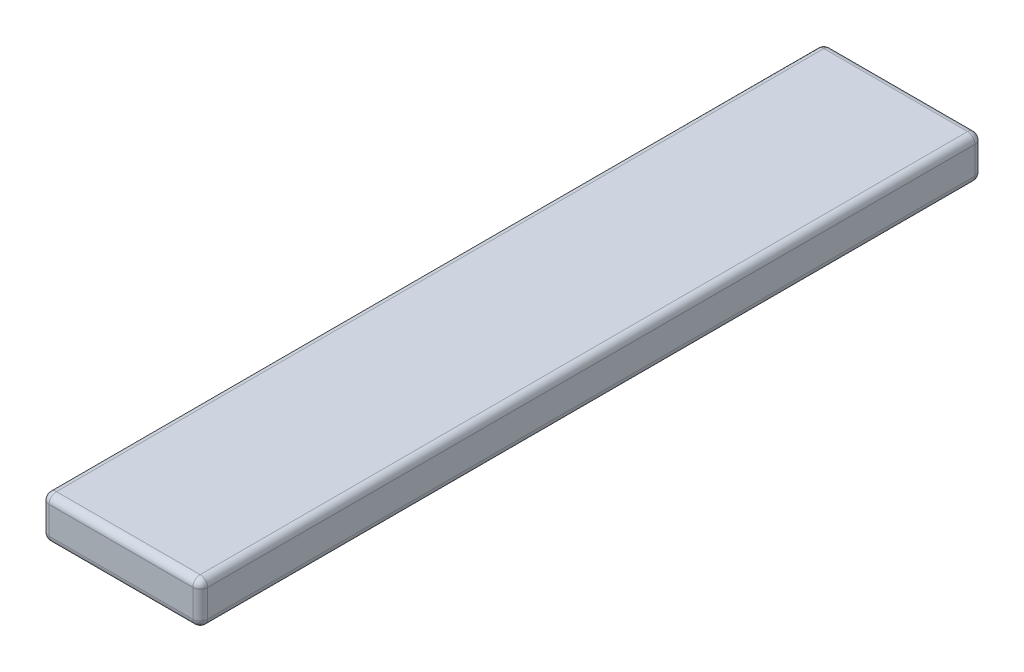
ISO-10303-21;
HEADER;
FILE_DESCRIPTION(('STEP AP214'),'2;1');
FILE_NAME('part.step','',(''),(''),'','','');
FILE_SCHEMA(('AUTOMOTIVE_DESIGN { 1 0 10303 214 1 1 1 1 }'));
ENDSEC;
DATA;
#1=APPLICATION_CONTEXT('core data for automotive mechanical design processes');
#2=APPLICATION_PROTOCOL_DEFINITION('international standard','automotive_design',2000,#1);
#3=PRODUCT_CONTEXT('',#1,'mechanical');
#4=PRODUCT('Part','Part','',(#3));
#5=PRODUCT_RELATED_PRODUCT_CATEGORY('part','',(#4));
#6=PRODUCT_DEFINITION_FORMATION('','',#4);
#7=PRODUCT_DEFINITION_CONTEXT('part definition',#1,'design');
#8=PRODUCT_DEFINITION('design','',#6,#7);
#9=PRODUCT_DEFINITION_SHAPE('','',#8);
#10=(LENGTH_UNIT() NAMED_UNIT(*) SI_UNIT(.MILLI.,.METRE.));
#11=(NAMED_UNIT(*) PLANE_ANGLE_UNIT() SI_UNIT($,.RADIAN.));
#12=(NAMED_UNIT(*) SI_UNIT($,.STERADIAN.) SOLID_ANGLE_UNIT());
#13=UNCERTAINTY_MEASURE_WITH_UNIT(LENGTH_MEASURE(1.E-05),#10,'distance_accuracy_value','');
#14=(GEOMETRIC_REPRESENTATION_CONTEXT(3) GLOBAL_UNCERTAINTY_ASSIGNED_CONTEXT((#13)) GLOBAL_UNIT_ASSIGNED_CONTEXT((#10,
#11,#12)) REPRESENTATION_CONTEXT('',''));
#15=CARTESIAN_POINT('',(0.,0.,0.));
#16=DIRECTION('',(0.,0.,1.));
#17=DIRECTION('',(1.,0.,0.));
#18=AXIS2_PLACEMENT_3D('',#15,#16,#17);
#19=CARTESIAN_POINT('',(375.,200.,-964.69465648855));
#20=DIRECTION('',(-1.,0.,0.));
#21=DIRECTION('',(0.,0.,1.));
#22=AXIS2_PLACEMENT_3D('',#19,#20,#21);
#23=PLANE('',#22);
#24=DIRECTION('',(0.,-1.,0.));
#25=VECTOR('',#24,1.);
#26=CARTESIAN_POINT('',(375.,200.,-929.69465648855));
#27=LINE('',#26,#25);
#28=CARTESIAN_POINT('',(375.,35.,-929.69465648855));
#29=VERTEX_POINT('',#28);
#30=CARTESIAN_POINT('',(375.,165.,-929.69465648855));
#31=VERTEX_POINT('',#30);
#32=EDGE_CURVE('E142',#29,#31,#27,.F.);
#33=ORIENTED_EDGE('',*,*,#32,.T.);
#34=DIRECTION('',(0.,0.,-1.));
#35=VECTOR('',#34,1.);
#36=CARTESIAN_POINT('',(375.,165.,2735.30534351145));
#37=LINE('',#36,#35);
#38=CARTESIAN_POINT('',(375.,165.,2700.30534351145));
#39=VERTEX_POINT('',#38);
#40=EDGE_CURVE('E188',#31,#39,#37,.F.);
#41=ORIENTED_EDGE('',*,*,#40,.T.);
#42=DIRECTION('',(0.,-1.,0.));
#43=VECTOR('',#42,1.);
#44=CARTESIAN_POINT('',(375.,200.,2700.30534351145));
#45=LINE('',#44,#43);
#46=CARTESIAN_POINT('',(375.,35.,2700.30534351145));
#47=VERTEX_POINT('',#46);
#48=EDGE_CURVE('E183',#39,#47,#45,.T.);
#49=ORIENTED_EDGE('',*,*,#48,.T.);
#50=DIRECTION('',(0.,0.,-1.));
#51=VECTOR('',#50,1.);
#52=CARTESIAN_POINT('',(375.,35.,-964.69465648855));
#53=LINE('',#52,#51);
#54=EDGE_CURVE('E177',#47,#29,#53,.T.);
#55=ORIENTED_EDGE('',*,*,#54,.T.);
#56=EDGE_LOOP('',(#33,#41,#49,#55));
#57=FACE_BOUND('',#56,.T.);
#58=ADVANCED_FACE('F45',(#57),#23,.F.);
#59=CARTESIAN_POINT('',(-375.,200.,-964.69465648855));
#60=DIRECTION('',(0.,0.,1.));
#61=DIRECTION('',(1.,0.,0.));
#62=AXIS2_PLACEMENT_3D('',#59,#60,#61);
#63=PLANE('',#62);
#64=DIRECTION('',(0.,-1.,0.));
#65=VECTOR('',#64,1.);
#66=CARTESIAN_POINT('',(-340.,200.,-964.69465648855));
#67=LINE('',#66,#65);
#68=CARTESIAN_POINT('',(-340.,35.,-964.69465648855));
#69=VERTEX_POINT('',#68);
#70=CARTESIAN_POINT('',(-340.,165.,-964.69465648855));
#71=VERTEX_POINT('',#70);
#72=EDGE_CURVE('E167',#69,#71,#67,.F.);
#73=ORIENTED_EDGE('',*,*,#72,.T.);
#74=DIRECTION('',(-1.,0.,0.));
#75=VECTOR('',#74,1.);
#76=CARTESIAN_POINT('',(375.,165.,-964.69465648855));
#77=LINE('',#76,#75);
#78=CARTESIAN_POINT('',(340.,165.,-964.69465648855));
#79=VERTEX_POINT('',#78);
#80=EDGE_CURVE('E171',#71,#79,#77,.F.);
#81=ORIENTED_EDGE('',*,*,#80,.T.);
#82=DIRECTION('',(0.,-1.,0.));
#83=VECTOR('',#82,1.);
#84=CARTESIAN_POINT('',(340.,200.,-964.69465648855));
#85=LINE('',#84,#83);
#86=CARTESIAN_POINT('',(340.,35.,-964.69465648855));
#87=VERTEX_POINT('',#86);
#88=EDGE_CURVE('E140',#79,#87,#85,.T.);
#89=ORIENTED_EDGE('',*,*,#88,.T.);
#90=DIRECTION('',(-1.,0.,0.));
#91=VECTOR('',#90,1.);
#92=CARTESIAN_POINT('',(-375.,35.,-964.69465648855));
#93=LINE('',#92,#91);
#94=EDGE_CURVE('E160',#87,#69,#93,.T.);
#95=ORIENTED_EDGE('',*,*,#94,.T.);
#96=EDGE_LOOP('',(#73,#81,#89,#95));
#97=FACE_BOUND('',#96,.T.);
#98=ADVANCED_FACE('F169',(#97),#63,.F.);
#99=CARTESIAN_POINT('',(-375.,200.,-964.69465648855));
#100=DIRECTION('',(1.,0.,0.));
#101=DIRECTION('',(0.,0.,-1.));
#102=AXIS2_PLACEMENT_3D('',#99,#100,#101);
#103=PLANE('',#102);
#104=DIRECTION('',(0.,-1.,0.));
#105=VECTOR('',#104,1.);
#106=CARTESIAN_POINT('',(-375.,200.,2700.30534351145));
#107=LINE('',#106,#105);
#108=CARTESIAN_POINT('',(-375.,35.,2700.30534351145));
#109=VERTEX_POINT('',#108);
#110=CARTESIAN_POINT('',(-375.,165.,2700.30534351145));
#111=VERTEX_POINT('',#110);
#112=EDGE_CURVE('E194',#109,#111,#107,.F.);
#113=ORIENTED_EDGE('',*,*,#112,.T.);
#114=DIRECTION('',(0.,0.,1.));
#115=VECTOR('',#114,1.);
#116=CARTESIAN_POINT('',(-375.,165.,-964.69465648855));
#117=LINE('',#116,#115);
#118=CARTESIAN_POINT('',(-375.,165.,-929.69465648855));
#119=VERTEX_POINT('',#118);
#120=EDGE_CURVE('E201',#111,#119,#117,.F.);
#121=ORIENTED_EDGE('',*,*,#120,.T.);
#122=DIRECTION('',(0.,-1.,0.));
#123=VECTOR('',#122,1.);
#124=CARTESIAN_POINT('',(-375.,200.,-929.69465648855));
#125=LINE('',#124,#123);
#126=CARTESIAN_POINT('',(-375.,35.,-929.69465648855));
#127=VERTEX_POINT('',#126);
#128=EDGE_CURVE('E197',#119,#127,#125,.T.);
#129=ORIENTED_EDGE('',*,*,#128,.T.);
#130=DIRECTION('',(0.,0.,1.));
#131=VECTOR('',#130,1.);
#132=CARTESIAN_POINT('',(-375.,35.,-964.69465648855));
#133=LINE('',#132,#131);
#134=EDGE_CURVE('E191',#127,#109,#133,.T.);
#135=ORIENTED_EDGE('',*,*,#134,.T.);
#136=EDGE_LOOP('',(#113,#121,#129,#135));
#137=FACE_BOUND('',#136,.T.);
#138=ADVANCED_FACE('F340',(#137),#103,.F.);
#139=CARTESIAN_POINT('',(-375.,200.,2735.30534351145));
#140=DIRECTION('',(0.,0.,-1.));
#141=DIRECTION('',(-1.,0.,0.));
#142=AXIS2_PLACEMENT_3D('',#139,#140,#141);
#143=PLANE('',#142);
#144=DIRECTION('',(0.,-1.,0.));
#145=VECTOR('',#144,1.);
#146=CARTESIAN_POINT('',(340.,200.,2735.30534351145));
#147=LINE('',#146,#145);
#148=CARTESIAN_POINT('',(340.,35.,2735.30534351145));
#149=VERTEX_POINT('',#148);
#150=CARTESIAN_POINT('',(340.,165.,2735.30534351145));
#151=VERTEX_POINT('',#150);
#152=EDGE_CURVE('E207',#149,#151,#147,.F.);
#153=ORIENTED_EDGE('',*,*,#152,.T.);
#154=DIRECTION('',(1.,0.,0.));
#155=VECTOR('',#154,1.);
#156=CARTESIAN_POINT('',(-375.,165.,2735.30534351145));
#157=LINE('',#156,#155);
#158=CARTESIAN_POINT('',(-340.,165.,2735.30534351145));
#159=VERTEX_POINT('',#158);
#160=EDGE_CURVE('E214',#151,#159,#157,.F.);
#161=ORIENTED_EDGE('',*,*,#160,.T.);
#162=DIRECTION('',(0.,-1.,0.));
#163=VECTOR('',#162,1.);
#164=CARTESIAN_POINT('',(-340.,200.,2735.30534351145));
#165=LINE('',#164,#163);
#166=CARTESIAN_POINT('',(-340.,35.,2735.30534351145));
#167=VERTEX_POINT('',#166);
#168=EDGE_CURVE('E210',#159,#167,#165,.T.);
#169=ORIENTED_EDGE('',*,*,#168,.T.);
#170=DIRECTION('',(1.,0.,0.));
#171=VECTOR('',#170,1.);
#172=CARTESIAN_POINT('',(-375.,35.,2735.30534351145));
#173=LINE('',#172,#171);
#174=EDGE_CURVE('E204',#167,#149,#173,.T.);
#175=ORIENTED_EDGE('',*,*,#174,.T.);
#176=EDGE_LOOP('',(#153,#161,#169,#175));
#177=FACE_BOUND('',#176,.T.);
#178=ADVANCED_FACE('F351',(#177),#143,.F.);
#179=CARTESIAN_POINT('',(0.,200.,0.));
#180=DIRECTION('',(0.,1.,0.));
#181=DIRECTION('',(0.,0.,1.));
#182=AXIS2_PLACEMENT_3D('',#179,#180,#181);
#183=PLANE('',#182);
#184=DIRECTION('',(0.,0.,1.));
#185=VECTOR('',#184,1.);
#186=CARTESIAN_POINT('',(-340.,200.,2735.30534351145));
#187=LINE('',#186,#185);
#188=CARTESIAN_POINT('',(-340.,200.,-929.69465648855));
#189=VERTEX_POINT('',#188);
#190=CARTESIAN_POINT('',(-340.,200.,2700.30534351145));
#191=VERTEX_POINT('',#190);
#192=EDGE_CURVE('E223',#189,#191,#187,.T.);
#193=ORIENTED_EDGE('',*,*,#192,.T.);
#194=DIRECTION('',(1.,0.,0.));
#195=VECTOR('',#194,1.);
#196=CARTESIAN_POINT('',(375.,200.,2700.30534351145));
#197=LINE('',#196,#195);
#198=CARTESIAN_POINT('',(340.,200.,2700.30534351145));
#199=VERTEX_POINT('',#198);
#200=EDGE_CURVE('E226',#191,#199,#197,.T.);
#201=ORIENTED_EDGE('',*,*,#200,.T.);
#202=DIRECTION('',(0.,0.,-1.));
#203=VECTOR('',#202,1.);
#204=CARTESIAN_POINT('',(340.,200.,-964.69465648855));
#205=LINE('',#204,#203);
#206=CARTESIAN_POINT('',(340.,200.,-929.69465648855));
#207=VERTEX_POINT('',#206);
#208=EDGE_CURVE('E217',#199,#207,#205,.T.);
#209=ORIENTED_EDGE('',*,*,#208,.T.);
#210=DIRECTION('',(-1.,0.,0.));
#211=VECTOR('',#210,1.);
#212=CARTESIAN_POINT('',(-375.,200.,-929.69465648855));
#213=LINE('',#212,#211);
#214=EDGE_CURVE('E220',#207,#189,#213,.T.);
#215=ORIENTED_EDGE('',*,*,#214,.T.);
#216=EDGE_LOOP('',(#193,#201,#209,#215));
#217=FACE_BOUND('',#216,.T.);
#218=ADVANCED_FACE('F332',(#217),#183,.T.);
#219=CARTESIAN_POINT('',(0.,0.,0.));
#220=DIRECTION('',(0.,1.,0.));
#221=DIRECTION('',(0.,0.,1.));
#222=AXIS2_PLACEMENT_3D('',#219,#220,#221);
#223=PLANE('',#222);
#224=DIRECTION('',(0.,0.,1.));
#225=VECTOR('',#224,1.);
#226=CARTESIAN_POINT('',(-340.,0.,0.));
#227=LINE('',#226,#225);
#228=CARTESIAN_POINT('',(-340.,0.,2700.30534351145));
#229=VERTEX_POINT('',#228);
#230=CARTESIAN_POINT('',(-340.,0.,-929.69465648855));
#231=VERTEX_POINT('',#230);
#232=EDGE_CURVE('E55',#229,#231,#227,.F.);
#233=ORIENTED_EDGE('',*,*,#232,.T.);
#234=DIRECTION('',(-1.,0.,0.));
#235=VECTOR('',#234,1.);
#236=CARTESIAN_POINT('',(0.,0.,-929.69465648855));
#237=LINE('',#236,#235);
#238=CARTESIAN_POINT('',(340.,0.,-929.69465648855));
#239=VERTEX_POINT('',#238);
#240=EDGE_CURVE('E11',#231,#239,#237,.F.);
#241=ORIENTED_EDGE('',*,*,#240,.T.);
#242=DIRECTION('',(0.,0.,-1.));
#243=VECTOR('',#242,1.);
#244=CARTESIAN_POINT('',(340.,0.,0.));
#245=LINE('',#244,#243);
#246=CARTESIAN_POINT('',(340.,0.,2700.30534351145));
#247=VERTEX_POINT('',#246);
#248=EDGE_CURVE('E230',#239,#247,#245,.F.);
#249=ORIENTED_EDGE('',*,*,#248,.T.);
#250=DIRECTION('',(1.,0.,0.));
#251=VECTOR('',#250,1.);
#252=CARTESIAN_POINT('',(0.,0.,2700.30534351145));
#253=LINE('',#252,#251);
#254=EDGE_CURVE('E66',#247,#229,#253,.F.);
#255=ORIENTED_EDGE('',*,*,#254,.T.);
#256=EDGE_LOOP('',(#233,#241,#249,#255));
#257=FACE_BOUND('',#256,.T.);
#258=ADVANCED_FACE('F577',(#257),#223,.F.);
#259=CARTESIAN_POINT('',(-340.,200.,2700.30534351145));
#260=DIRECTION('',(0.,-1.,0.));
#261=DIRECTION('',(0.,0.,-1.));
#262=AXIS2_PLACEMENT_3D('',#259,#260,#261);
#263=CYLINDRICAL_SURFACE('',#262,35.);
#264=CARTESIAN_POINT('',(-340.,165.,2700.30534351145));
#265=DIRECTION('',(0.,1.,0.));
#266=DIRECTION('',(0.,0.,1.));
#267=AXIS2_PLACEMENT_3D('',#264,#265,#266);
#268=CIRCLE('',#267,35.);
#269=EDGE_CURVE('E49',#111,#159,#268,.T.);
#270=ORIENTED_EDGE('',*,*,#269,.F.);
#271=ORIENTED_EDGE('',*,*,#112,.F.);
#272=CARTESIAN_POINT('',(-340.,35.,2700.30534351145));
#273=DIRECTION('',(0.,-1.,0.));
#274=DIRECTION('',(0.,0.,-1.));
#275=AXIS2_PLACEMENT_3D('',#272,#273,#274);
#276=CIRCLE('',#275,35.);
#277=EDGE_CURVE('E307',#167,#109,#276,.T.);
#278=ORIENTED_EDGE('',*,*,#277,.F.);
#279=ORIENTED_EDGE('',*,*,#168,.F.);
#280=EDGE_LOOP('',(#270,#271,#278,#279));
#281=FACE_BOUND('',#280,.T.);
#282=ADVANCED_FACE('F47',(#281),#263,.T.);
#283=CARTESIAN_POINT('',(-340.,165.,2700.30534351145));
#284=DIRECTION('',(0.,0.,1.));
#285=DIRECTION('',(1.,0.,0.));
#286=AXIS2_PLACEMENT_3D('',#283,#284,#285);
#287=SPHERICAL_SURFACE('',#286,35.);
#288=CARTESIAN_POINT('',(-340.,165.,2700.30534351145));
#289=DIRECTION('',(0.,0.,1.));
#290=DIRECTION('',(1.,0.,0.));
#291=AXIS2_PLACEMENT_3D('',#288,#289,#290);
#292=CIRCLE('',#291,35.);
#293=EDGE_CURVE('E300',#111,#191,#292,.F.);
#294=ORIENTED_EDGE('',*,*,#293,.F.);
#295=ORIENTED_EDGE('',*,*,#269,.T.);
#296=CARTESIAN_POINT('',(-340.,165.,2700.30534351145));
#297=DIRECTION('',(-1.,0.,0.));
#298=DIRECTION('',(0.,0.,1.));
#299=AXIS2_PLACEMENT_3D('',#296,#297,#298);
#300=CIRCLE('',#299,35.);
#301=EDGE_CURVE('E304',#191,#159,#300,.F.);
#302=ORIENTED_EDGE('',*,*,#301,.F.);
#303=EDGE_LOOP('',(#294,#295,#302));
#304=FACE_BOUND('',#303,.T.);
#305=ADVANCED_FACE('F320',(#304),#287,.T.);
#306=CARTESIAN_POINT('',(-340.,35.,2700.30534351145));
#307=DIRECTION('',(-1.,0.,0.));
#308=DIRECTION('',(0.,0.,1.));
#309=AXIS2_PLACEMENT_3D('',#306,#307,#308);
#310=SPHERICAL_SURFACE('',#309,35.);
#311=CARTESIAN_POINT('',(-340.,35.,2700.30534351145));
#312=DIRECTION('',(-1.,0.,0.));
#313=DIRECTION('',(0.,0.,1.));
#314=AXIS2_PLACEMENT_3D('',#311,#312,#313);
#315=CIRCLE('',#314,35.);
#316=EDGE_CURVE('E293',#167,#229,#315,.F.);
#317=ORIENTED_EDGE('',*,*,#316,.F.);
#318=ORIENTED_EDGE('',*,*,#277,.T.);
#319=CARTESIAN_POINT('',(-340.,35.,2700.30534351145));
#320=DIRECTION('',(0.,0.,1.));
#321=DIRECTION('',(1.,0.,0.));
#322=AXIS2_PLACEMENT_3D('',#319,#320,#321);
#323=CIRCLE('',#322,35.);
#324=EDGE_CURVE('E296',#229,#109,#323,.F.);
#325=ORIENTED_EDGE('',*,*,#324,.F.);
#326=EDGE_LOOP('',(#317,#318,#325));
#327=FACE_BOUND('',#326,.T.);
#328=ADVANCED_FACE('F550',(#327),#310,.T.);
#329=CARTESIAN_POINT('',(0.,165.,2700.30534351145));
#330=DIRECTION('',(-1.,0.,0.));
#331=DIRECTION('',(0.,0.,1.));
#332=AXIS2_PLACEMENT_3D('',#329,#330,#331);
#333=CYLINDRICAL_SURFACE('',#332,35.);
#334=ORIENTED_EDGE('',*,*,#301,.T.);
#335=ORIENTED_EDGE('',*,*,#160,.F.);
#336=CARTESIAN_POINT('',(340.,165.,2700.30534351145));
#337=DIRECTION('',(1.,0.,0.));
#338=DIRECTION('',(0.,0.,-1.));
#339=AXIS2_PLACEMENT_3D('',#336,#337,#338);
#340=CIRCLE('',#339,35.);
#341=EDGE_CURVE('E285',#199,#151,#340,.T.);
#342=ORIENTED_EDGE('',*,*,#341,.F.);
#343=ORIENTED_EDGE('',*,*,#200,.F.);
#344=EDGE_LOOP('',(#334,#335,#342,#343));
#345=FACE_BOUND('',#344,.T.);
#346=ADVANCED_FACE('F328',(#345),#333,.T.);
#347=CARTESIAN_POINT('',(-340.,165.,0.));
#348=DIRECTION('',(0.,0.,-1.));
#349=DIRECTION('',(-1.,0.,0.));
#350=AXIS2_PLACEMENT_3D('',#347,#348,#349);
#351=CYLINDRICAL_SURFACE('',#350,35.);
#352=ORIENTED_EDGE('',*,*,#293,.T.);
#353=ORIENTED_EDGE('',*,*,#192,.F.);
#354=CARTESIAN_POINT('',(-340.,165.,-929.69465648855));
#355=DIRECTION('',(0.,0.,-1.));
#356=DIRECTION('',(-1.,0.,0.));
#357=AXIS2_PLACEMENT_3D('',#354,#355,#356);
#358=CIRCLE('',#357,35.);
#359=EDGE_CURVE('E281',#119,#189,#358,.T.);
#360=ORIENTED_EDGE('',*,*,#359,.F.);
#361=ORIENTED_EDGE('',*,*,#120,.F.);
#362=EDGE_LOOP('',(#352,#353,#360,#361));
#363=FACE_BOUND('',#362,.T.);
#364=ADVANCED_FACE('F337',(#363),#351,.T.);
#365=CARTESIAN_POINT('',(-340.,200.,-929.69465648855));
#366=DIRECTION('',(0.,-1.,0.));
#367=DIRECTION('',(0.,0.,-1.));
#368=AXIS2_PLACEMENT_3D('',#365,#366,#367);
#369=CYLINDRICAL_SURFACE('',#368,35.);
#370=CARTESIAN_POINT('',(-340.,35.,-929.69465648855));
#371=DIRECTION('',(0.,-1.,0.));
#372=DIRECTION('',(0.,0.,-1.));
#373=AXIS2_PLACEMENT_3D('',#370,#371,#372);
#374=CIRCLE('',#373,35.);
#375=EDGE_CURVE('E273',#127,#69,#374,.T.);
#376=ORIENTED_EDGE('',*,*,#375,.F.);
#377=ORIENTED_EDGE('',*,*,#128,.F.);
#378=CARTESIAN_POINT('',(-340.,165.,-929.69465648855));
#379=DIRECTION('',(0.,1.,0.));
#380=DIRECTION('',(0.,0.,1.));
#381=AXIS2_PLACEMENT_3D('',#378,#379,#380);
#382=CIRCLE('',#381,35.);
#383=EDGE_CURVE('E277',#71,#119,#382,.T.);
#384=ORIENTED_EDGE('',*,*,#383,.F.);
#385=ORIENTED_EDGE('',*,*,#72,.F.);
#386=EDGE_LOOP('',(#376,#377,#384,#385));
#387=FACE_BOUND('',#386,.T.);
#388=ADVANCED_FACE('F344',(#387),#369,.T.);
#389=CARTESIAN_POINT('',(-340.,35.,-964.69465648855));
#390=DIRECTION('',(0.,0.,1.));
#391=DIRECTION('',(1.,0.,0.));
#392=AXIS2_PLACEMENT_3D('',#389,#390,#391);
#393=CYLINDRICAL_SURFACE('',#392,35.);
#394=ORIENTED_EDGE('',*,*,#324,.T.);
#395=ORIENTED_EDGE('',*,*,#134,.F.);
#396=CARTESIAN_POINT('',(-340.,35.,-929.69465648855));
#397=DIRECTION('',(0.,0.,-1.));
#398=DIRECTION('',(-1.,0.,0.));
#399=AXIS2_PLACEMENT_3D('',#396,#397,#398);
#400=CIRCLE('',#399,35.);
#401=EDGE_CURVE('E270',#231,#127,#400,.T.);
#402=ORIENTED_EDGE('',*,*,#401,.F.);
#403=ORIENTED_EDGE('',*,*,#232,.F.);
#404=EDGE_LOOP('',(#394,#395,#402,#403));
#405=FACE_BOUND('',#404,.T.);
#406=ADVANCED_FACE('F349',(#405),#393,.T.);
#407=CARTESIAN_POINT('',(-375.,35.,2700.30534351145));
#408=DIRECTION('',(1.,0.,0.));
#409=DIRECTION('',(0.,0.,-1.));
#410=AXIS2_PLACEMENT_3D('',#407,#408,#409);
#411=CYLINDRICAL_SURFACE('',#410,35.);
#412=ORIENTED_EDGE('',*,*,#316,.T.);
#413=ORIENTED_EDGE('',*,*,#254,.F.);
#414=CARTESIAN_POINT('',(340.,35.,2700.30534351145));
#415=DIRECTION('',(1.,0.,0.));
#416=DIRECTION('',(0.,0.,-1.));
#417=AXIS2_PLACEMENT_3D('',#414,#415,#416);
#418=CIRCLE('',#417,35.);
#419=EDGE_CURVE('E266',#149,#247,#418,.T.);
#420=ORIENTED_EDGE('',*,*,#419,.F.);
#421=ORIENTED_EDGE('',*,*,#174,.F.);
#422=EDGE_LOOP('',(#412,#413,#420,#421));
#423=FACE_BOUND('',#422,.T.);
#424=ADVANCED_FACE('F360',(#423),#411,.T.);
#425=CARTESIAN_POINT('',(340.,200.,2700.30534351145));
#426=DIRECTION('',(0.,-1.,0.));
#427=DIRECTION('',(0.,0.,-1.));
#428=AXIS2_PLACEMENT_3D('',#425,#426,#427);
#429=CYLINDRICAL_SURFACE('',#428,35.);
#430=CARTESIAN_POINT('',(340.,165.,2700.30534351145));
#431=DIRECTION('',(0.,1.,0.));
#432=DIRECTION('',(0.,0.,1.));
#433=AXIS2_PLACEMENT_3D('',#430,#431,#432);
#434=CIRCLE('',#433,35.);
#435=EDGE_CURVE('E289',#151,#39,#434,.T.);
#436=ORIENTED_EDGE('',*,*,#435,.F.);
#437=ORIENTED_EDGE('',*,*,#152,.F.);
#438=CARTESIAN_POINT('',(340.,35.,2700.30534351145));
#439=DIRECTION('',(0.,-1.,0.));
#440=DIRECTION('',(0.,0.,-1.));
#441=AXIS2_PLACEMENT_3D('',#438,#439,#440);
#442=CIRCLE('',#441,35.);
#443=EDGE_CURVE('E262',#47,#149,#442,.T.);
#444=ORIENTED_EDGE('',*,*,#443,.F.);
#445=ORIENTED_EDGE('',*,*,#48,.F.);
#446=EDGE_LOOP('',(#436,#437,#444,#445));
#447=FACE_BOUND('',#446,.T.);
#448=ADVANCED_FACE('F356',(#447),#429,.T.);
#449=CARTESIAN_POINT('',(340.,165.,2700.30534351145));
#450=DIRECTION('',(0.,0.,1.));
#451=DIRECTION('',(1.,0.,0.));
#452=AXIS2_PLACEMENT_3D('',#449,#450,#451);
#453=SPHERICAL_SURFACE('',#452,35.);
#454=ORIENTED_EDGE('',*,*,#341,.T.);
#455=ORIENTED_EDGE('',*,*,#435,.T.);
#456=CARTESIAN_POINT('',(340.,165.,2700.30534351145));
#457=DIRECTION('',(0.,0.,1.));
#458=DIRECTION('',(1.,0.,0.));
#459=AXIS2_PLACEMENT_3D('',#456,#457,#458);
#460=CIRCLE('',#459,35.);
#461=EDGE_CURVE('E258',#199,#39,#460,.F.);
#462=ORIENTED_EDGE('',*,*,#461,.F.);
#463=EDGE_LOOP('',(#454,#455,#462));
#464=FACE_BOUND('',#463,.T.);
#465=ADVANCED_FACE('F370',(#464),#453,.T.);
#466=CARTESIAN_POINT('',(-340.,165.,-929.69465648855));
#467=DIRECTION('',(-1.,0.,0.));
#468=DIRECTION('',(0.,0.,1.));
#469=AXIS2_PLACEMENT_3D('',#466,#467,#468);
#470=SPHERICAL_SURFACE('',#469,35.);
#471=ORIENTED_EDGE('',*,*,#383,.T.);
#472=ORIENTED_EDGE('',*,*,#359,.T.);
#473=CARTESIAN_POINT('',(-340.,165.,-929.69465648855));
#474=DIRECTION('',(-1.,0.,0.));
#475=DIRECTION('',(0.,0.,1.));
#476=AXIS2_PLACEMENT_3D('',#473,#474,#475);
#477=CIRCLE('',#476,35.);
#478=EDGE_CURVE('E254',#71,#189,#477,.F.);
#479=ORIENTED_EDGE('',*,*,#478,.F.);
#480=EDGE_LOOP('',(#471,#472,#479));
#481=FACE_BOUND('',#480,.T.);
#482=ADVANCED_FACE('F380',(#481),#470,.T.);
#483=CARTESIAN_POINT('',(-340.,35.,-929.69465648855));
#484=DIRECTION('',(-1.,0.,0.));
#485=DIRECTION('',(0.,0.,1.));
#486=AXIS2_PLACEMENT_3D('',#483,#484,#485);
#487=SPHERICAL_SURFACE('',#486,35.);
#488=ORIENTED_EDGE('',*,*,#401,.T.);
#489=ORIENTED_EDGE('',*,*,#375,.T.);
#490=CARTESIAN_POINT('',(-340.,35.,-929.69465648855));
#491=DIRECTION('',(-1.,0.,0.));
#492=DIRECTION('',(0.,0.,1.));
#493=AXIS2_PLACEMENT_3D('',#490,#491,#492);
#494=CIRCLE('',#493,35.);
#495=EDGE_CURVE('E163',#231,#69,#494,.F.);
#496=ORIENTED_EDGE('',*,*,#495,.F.);
#497=EDGE_LOOP('',(#488,#489,#496));
#498=FACE_BOUND('',#497,.T.);
#499=ADVANCED_FACE('F382',(#498),#487,.T.);
#500=CARTESIAN_POINT('',(340.,35.,2700.30534351145));
#501=DIRECTION('',(0.,0.,1.));
#502=DIRECTION('',(1.,0.,0.));
#503=AXIS2_PLACEMENT_3D('',#500,#501,#502);
#504=SPHERICAL_SURFACE('',#503,35.);
#505=ORIENTED_EDGE('',*,*,#443,.T.);
#506=ORIENTED_EDGE('',*,*,#419,.T.);
#507=CARTESIAN_POINT('',(340.,35.,2700.30534351145));
#508=DIRECTION('',(0.,0.,1.));
#509=DIRECTION('',(1.,0.,0.));
#510=AXIS2_PLACEMENT_3D('',#507,#508,#509);
#511=CIRCLE('',#510,35.);
#512=EDGE_CURVE('E248',#47,#247,#511,.F.);
#513=ORIENTED_EDGE('',*,*,#512,.F.);
#514=EDGE_LOOP('',(#505,#506,#513));
#515=FACE_BOUND('',#514,.T.);
#516=ADVANCED_FACE('F362',(#515),#504,.T.);
#517=CARTESIAN_POINT('',(340.,165.,0.));
#518=DIRECTION('',(0.,0.,1.));
#519=DIRECTION('',(1.,0.,0.));
#520=AXIS2_PLACEMENT_3D('',#517,#518,#519);
#521=CYLINDRICAL_SURFACE('',#520,35.);
#522=ORIENTED_EDGE('',*,*,#461,.T.);
#523=ORIENTED_EDGE('',*,*,#40,.F.);
#524=CARTESIAN_POINT('',(340.,165.,-929.69465648855));
#525=DIRECTION('',(0.,0.,-1.));
#526=DIRECTION('',(-1.,0.,0.));
#527=AXIS2_PLACEMENT_3D('',#524,#525,#526);
#528=CIRCLE('',#527,35.);
#529=EDGE_CURVE('E244',#207,#31,#528,.T.);
#530=ORIENTED_EDGE('',*,*,#529,.F.);
#531=ORIENTED_EDGE('',*,*,#208,.F.);
#532=EDGE_LOOP('',(#522,#523,#530,#531));
#533=FACE_BOUND('',#532,.T.);
#534=ADVANCED_FACE('F372',(#533),#521,.T.);
#535=CARTESIAN_POINT('',(0.,165.,-929.69465648855));
#536=DIRECTION('',(1.,0.,0.));
#537=DIRECTION('',(0.,0.,-1.));
#538=AXIS2_PLACEMENT_3D('',#535,#536,#537);
#539=CYLINDRICAL_SURFACE('',#538,35.);
#540=ORIENTED_EDGE('',*,*,#478,.T.);
#541=ORIENTED_EDGE('',*,*,#214,.F.);
#542=CARTESIAN_POINT('',(340.,165.,-929.69465648855));
#543=DIRECTION('',(1.,0.,0.));
#544=DIRECTION('',(0.,1.,0.));
#545=AXIS2_PLACEMENT_3D('',#542,#543,#544);
#546=CIRCLE('',#545,35.);
#547=EDGE_CURVE('E157',#79,#207,#546,.T.);
#548=ORIENTED_EDGE('',*,*,#547,.F.);
#549=ORIENTED_EDGE('',*,*,#80,.F.);
#550=EDGE_LOOP('',(#540,#541,#548,#549));
#551=FACE_BOUND('',#550,.T.);
#552=ADVANCED_FACE('F378',(#551),#539,.T.);
#553=CARTESIAN_POINT('',(-375.,35.,-929.69465648855));
#554=DIRECTION('',(-1.,0.,0.));
#555=DIRECTION('',(0.,0.,1.));
#556=AXIS2_PLACEMENT_3D('',#553,#554,#555);
#557=CYLINDRICAL_SURFACE('',#556,35.);
#558=ORIENTED_EDGE('',*,*,#495,.T.);
#559=ORIENTED_EDGE('',*,*,#94,.F.);
#560=CARTESIAN_POINT('',(340.,35.,-929.69465648855));
#561=DIRECTION('',(1.,0.,0.));
#562=DIRECTION('',(0.,0.,-1.));
#563=AXIS2_PLACEMENT_3D('',#560,#561,#562);
#564=CIRCLE('',#563,35.);
#565=EDGE_CURVE('E148',#239,#87,#564,.T.);
#566=ORIENTED_EDGE('',*,*,#565,.F.);
#567=ORIENTED_EDGE('',*,*,#240,.F.);
#568=EDGE_LOOP('',(#558,#559,#566,#567));
#569=FACE_BOUND('',#568,.T.);
#570=ADVANCED_FACE('F161',(#569),#557,.T.);
#571=CARTESIAN_POINT('',(340.,35.,-964.69465648855));
#572=DIRECTION('',(0.,0.,-1.));
#573=DIRECTION('',(-1.,0.,0.));
#574=AXIS2_PLACEMENT_3D('',#571,#572,#573);
#575=CYLINDRICAL_SURFACE('',#574,35.);
#576=ORIENTED_EDGE('',*,*,#512,.T.);
#577=ORIENTED_EDGE('',*,*,#248,.F.);
#578=CARTESIAN_POINT('',(340.,35.,-929.69465648855));
#579=DIRECTION('',(0.,0.,-1.));
#580=DIRECTION('',(-1.,0.,0.));
#581=AXIS2_PLACEMENT_3D('',#578,#579,#580);
#582=CIRCLE('',#581,35.);
#583=EDGE_CURVE('E152',#29,#239,#582,.T.);
#584=ORIENTED_EDGE('',*,*,#583,.F.);
#585=ORIENTED_EDGE('',*,*,#54,.F.);
#586=EDGE_LOOP('',(#576,#577,#584,#585));
#587=FACE_BOUND('',#586,.T.);
#588=ADVANCED_FACE('F365',(#587),#575,.T.);
#589=CARTESIAN_POINT('',(340.,165.,-929.69465648855));
#590=DIRECTION('',(0.,1.,0.));
#591=DIRECTION('',(0.,0.,1.));
#592=AXIS2_PLACEMENT_3D('',#589,#590,#591);
#593=SPHERICAL_SURFACE('',#592,35.);
#594=ORIENTED_EDGE('',*,*,#547,.T.);
#595=ORIENTED_EDGE('',*,*,#529,.T.);
#596=CARTESIAN_POINT('',(340.,165.,-929.69465648855));
#597=DIRECTION('',(0.,1.,0.));
#598=DIRECTION('',(0.,0.,1.));
#599=AXIS2_PLACEMENT_3D('',#596,#597,#598);
#600=CIRCLE('',#599,35.);
#601=EDGE_CURVE('E145',#79,#31,#600,.F.);
#602=ORIENTED_EDGE('',*,*,#601,.F.);
#603=EDGE_LOOP('',(#594,#595,#602));
#604=FACE_BOUND('',#603,.T.);
#605=ADVANCED_FACE('F376',(#604),#593,.T.);
#606=CARTESIAN_POINT('',(340.,35.,-929.69465648855));
#607=DIRECTION('',(0.,-1.,0.));
#608=DIRECTION('',(0.,0.,-1.));
#609=AXIS2_PLACEMENT_3D('',#606,#607,#608);
#610=SPHERICAL_SURFACE('',#609,35.);
#611=ORIENTED_EDGE('',*,*,#583,.T.);
#612=ORIENTED_EDGE('',*,*,#565,.T.);
#613=CARTESIAN_POINT('',(340.,35.,-929.69465648855));
#614=DIRECTION('',(0.,-1.,0.));
#615=DIRECTION('',(0.,0.,-1.));
#616=AXIS2_PLACEMENT_3D('',#613,#614,#615);
#617=CIRCLE('',#616,35.);
#618=EDGE_CURVE('E136',#29,#87,#617,.F.);
#619=ORIENTED_EDGE('',*,*,#618,.F.);
#620=EDGE_LOOP('',(#611,#612,#619));
#621=FACE_BOUND('',#620,.T.);
#622=ADVANCED_FACE('F150',(#621),#610,.T.);
#623=CARTESIAN_POINT('',(340.,200.,-929.69465648855));
#624=DIRECTION('',(0.,-1.,0.));
#625=DIRECTION('',(0.,0.,-1.));
#626=AXIS2_PLACEMENT_3D('',#623,#624,#625);
#627=CYLINDRICAL_SURFACE('',#626,35.);
#628=ORIENTED_EDGE('',*,*,#601,.T.);
#629=ORIENTED_EDGE('',*,*,#32,.F.);
#630=ORIENTED_EDGE('',*,*,#618,.T.);
#631=ORIENTED_EDGE('',*,*,#88,.F.);
#632=EDGE_LOOP('',(#628,#629,#630,#631));
#633=FACE_BOUND('',#632,.T.);
#634=ADVANCED_FACE('F138',(#633),#627,.T.);
#635=CLOSED_SHELL('',(#58,#98,#138,#178,#218,#258,#282,#305,#328,#346,#364,#388,#406,#424,#448,
#465,#482,#499,#516,#534,#552,#570,#588,#605,#622,#634));
#636=MANIFOLD_SOLID_BREP('B2',#635);
#637=ADVANCED_BREP_SHAPE_REPRESENTATION('',(#18,#636),#14);
#638=SHAPE_DEFINITION_REPRESENTATION(#9,#637);
ENDSEC;
END-ISO-10303-21;
